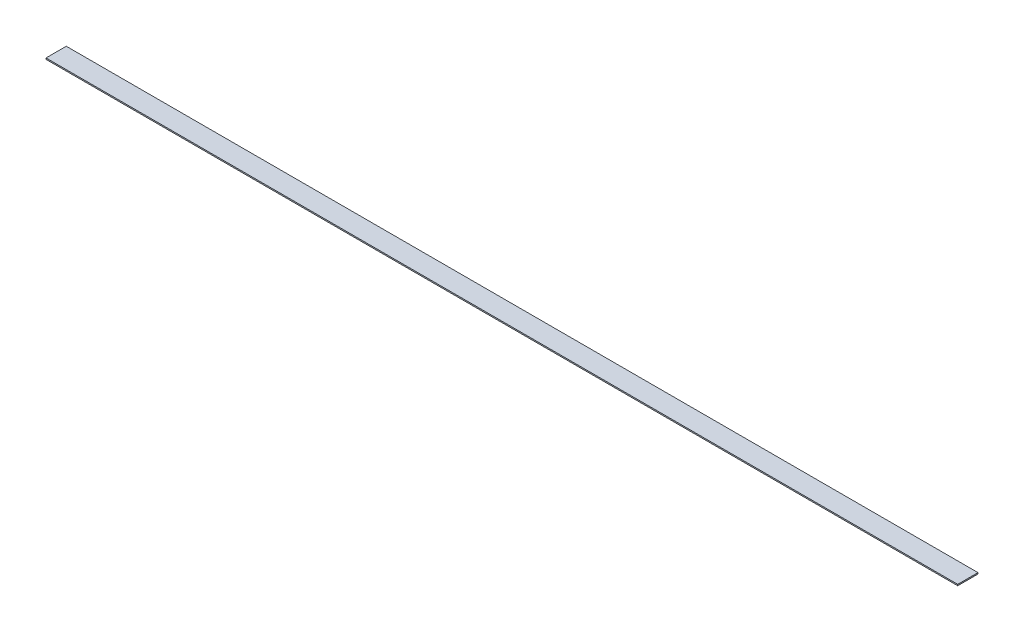
ISO-10303-21;
HEADER;
FILE_DESCRIPTION(('STEP AP214'),'2;1');
FILE_NAME('part.step','',(''),(''),'','','');
FILE_SCHEMA(('AUTOMOTIVE_DESIGN { 1 0 10303 214 1 1 1 1 }'));
ENDSEC;
DATA;
#1=APPLICATION_CONTEXT('core data for automotive mechanical design processes');
#2=APPLICATION_PROTOCOL_DEFINITION('international standard','automotive_design',2000,#1);
#3=PRODUCT_CONTEXT('',#1,'mechanical');
#4=PRODUCT('Part','Part','',(#3));
#5=PRODUCT_RELATED_PRODUCT_CATEGORY('part','',(#4));
#6=PRODUCT_DEFINITION_FORMATION('','',#4);
#7=PRODUCT_DEFINITION_CONTEXT('part definition',#1,'design');
#8=PRODUCT_DEFINITION('design','',#6,#7);
#9=PRODUCT_DEFINITION_SHAPE('','',#8);
#10=(LENGTH_UNIT() NAMED_UNIT(*) SI_UNIT(.MILLI.,.METRE.));
#11=(NAMED_UNIT(*) PLANE_ANGLE_UNIT() SI_UNIT($,.RADIAN.));
#12=(NAMED_UNIT(*) SI_UNIT($,.STERADIAN.) SOLID_ANGLE_UNIT());
#13=UNCERTAINTY_MEASURE_WITH_UNIT(LENGTH_MEASURE(1.E-05),#10,'distance_accuracy_value','');
#14=(GEOMETRIC_REPRESENTATION_CONTEXT(3) GLOBAL_UNCERTAINTY_ASSIGNED_CONTEXT((#13)) GLOBAL_UNIT_ASSIGNED_CONTEXT((#10,
#11,#12)) REPRESENTATION_CONTEXT('',''));
#15=CARTESIAN_POINT('',(0.,0.,0.));
#16=DIRECTION('',(0.,0.,1.));
#17=DIRECTION('',(1.,0.,0.));
#18=AXIS2_PLACEMENT_3D('',#15,#16,#17);
#19=CARTESIAN_POINT('',(0.,1.58750000000001,0.));
#20=DIRECTION('',(1.,0.,0.));
#21=DIRECTION('',(0.,0.,-1.));
#22=AXIS2_PLACEMENT_3D('',#19,#20,#21);
#23=PLANE('',#22);
#24=DIRECTION('',(0.,0.,1.));
#25=VECTOR('',#24,1.);
#26=CARTESIAN_POINT('',(0.,0.,0.));
#27=LINE('',#26,#25);
#28=CARTESIAN_POINT('',(0.,0.,-25.4));
#29=VERTEX_POINT('',#28);
#30=CARTESIAN_POINT('',(0.,0.,0.));
#31=VERTEX_POINT('',#30);
#32=EDGE_CURVE('E95',#29,#31,#27,.T.);
#33=ORIENTED_EDGE('',*,*,#32,.T.);
#34=DIRECTION('',(0.,-1.,0.));
#35=VECTOR('',#34,1.);
#36=CARTESIAN_POINT('',(0.,1.58750000000001,0.));
#37=LINE('',#36,#35);
#38=CARTESIAN_POINT('',(0.,1.58750000000001,0.));
#39=VERTEX_POINT('',#38);
#40=EDGE_CURVE('E11',#39,#31,#37,.T.);
#41=ORIENTED_EDGE('',*,*,#40,.F.);
#42=DIRECTION('',(0.,0.,1.));
#43=VECTOR('',#42,1.);
#44=CARTESIAN_POINT('',(0.,1.58750000000001,0.));
#45=LINE('',#44,#43);
#46=CARTESIAN_POINT('',(0.,1.58749999999999,-25.4));
#47=VERTEX_POINT('',#46);
#48=EDGE_CURVE('E83',#47,#39,#45,.T.);
#49=ORIENTED_EDGE('',*,*,#48,.F.);
#50=DIRECTION('',(0.,-1.,0.));
#51=VECTOR('',#50,1.);
#52=CARTESIAN_POINT('',(0.,1.58749999999999,-25.4));
#53=LINE('',#52,#51);
#54=EDGE_CURVE('E91',#47,#29,#53,.T.);
#55=ORIENTED_EDGE('',*,*,#54,.T.);
#56=EDGE_LOOP('',(#33,#41,#49,#55));
#57=FACE_BOUND('',#56,.T.);
#58=ADVANCED_FACE('F32',(#57),#23,.F.);
#59=CARTESIAN_POINT('',(0.,1.58750000000001,0.));
#60=DIRECTION('',(0.,0.,-1.));
#61=DIRECTION('',(-1.,0.,0.));
#62=AXIS2_PLACEMENT_3D('',#59,#60,#61);
#63=PLANE('',#62);
#64=DIRECTION('',(1.,0.,0.));
#65=VECTOR('',#64,1.);
#66=CARTESIAN_POINT('',(0.,0.,0.));
#67=LINE('',#66,#65);
#68=CARTESIAN_POINT('',(1143.,9.29811783123569E-13,0.));
#69=VERTEX_POINT('',#68);
#70=EDGE_CURVE('E87',#31,#69,#67,.T.);
#71=ORIENTED_EDGE('',*,*,#70,.T.);
#72=DIRECTION('',(0.,-1.,0.));
#73=VECTOR('',#72,1.);
#74=CARTESIAN_POINT('',(1143.,1.58750000000092,0.));
#75=LINE('',#74,#73);
#76=CARTESIAN_POINT('',(1143.,1.58750000000092,0.));
#77=VERTEX_POINT('',#76);
#78=EDGE_CURVE('E40',#77,#69,#75,.T.);
#79=ORIENTED_EDGE('',*,*,#78,.F.);
#80=DIRECTION('',(1.,0.,0.));
#81=VECTOR('',#80,1.);
#82=CARTESIAN_POINT('',(0.,1.58750000000001,0.));
#83=LINE('',#82,#81);
#84=EDGE_CURVE('E78',#39,#77,#83,.T.);
#85=ORIENTED_EDGE('',*,*,#84,.F.);
#86=ORIENTED_EDGE('',*,*,#40,.T.);
#87=EDGE_LOOP('',(#71,#79,#85,#86));
#88=FACE_BOUND('',#87,.T.);
#89=ADVANCED_FACE('F86',(#88),#63,.F.);
#90=CARTESIAN_POINT('',(1143.,1.58750000000092,0.));
#91=DIRECTION('',(-1.,0.,0.));
#92=DIRECTION('',(0.,0.,1.));
#93=AXIS2_PLACEMENT_3D('',#90,#91,#92);
#94=PLANE('',#93);
#95=DIRECTION('',(0.,0.,-1.));
#96=VECTOR('',#95,1.);
#97=CARTESIAN_POINT('',(1143.,9.29811783123569E-13,0.));
#98=LINE('',#97,#96);
#99=CARTESIAN_POINT('',(1143.,8.74300631892311E-13,-25.4));
#100=VERTEX_POINT('',#99);
#101=EDGE_CURVE('E65',#69,#100,#98,.T.);
#102=ORIENTED_EDGE('',*,*,#101,.T.);
#103=DIRECTION('',(0.,-1.,0.));
#104=VECTOR('',#103,1.);
#105=CARTESIAN_POINT('',(1143.,1.58750000000088,-25.4));
#106=LINE('',#105,#104);
#107=CARTESIAN_POINT('',(1143.,1.58750000000088,-25.4));
#108=VERTEX_POINT('',#107);
#109=EDGE_CURVE('E88',#108,#100,#106,.T.);
#110=ORIENTED_EDGE('',*,*,#109,.F.);
#111=DIRECTION('',(0.,0.,-1.));
#112=VECTOR('',#111,1.);
#113=CARTESIAN_POINT('',(1143.,1.58750000000092,0.));
#114=LINE('',#113,#112);
#115=EDGE_CURVE('E81',#77,#108,#114,.T.);
#116=ORIENTED_EDGE('',*,*,#115,.F.);
#117=ORIENTED_EDGE('',*,*,#78,.T.);
#118=EDGE_LOOP('',(#102,#110,#116,#117));
#119=FACE_BOUND('',#118,.T.);
#120=ADVANCED_FACE('F89',(#119),#94,.F.);
#121=CARTESIAN_POINT('',(0.,1.58749999999999,-25.4));
#122=DIRECTION('',(0.,0.,1.));
#123=DIRECTION('',(1.,0.,0.));
#124=AXIS2_PLACEMENT_3D('',#121,#122,#123);
#125=PLANE('',#124);
#126=DIRECTION('',(-1.,0.,0.));
#127=VECTOR('',#126,1.);
#128=CARTESIAN_POINT('',(0.,0.,-25.4));
#129=LINE('',#128,#127);
#130=EDGE_CURVE('E71',#100,#29,#129,.T.);
#131=ORIENTED_EDGE('',*,*,#130,.T.);
#132=ORIENTED_EDGE('',*,*,#54,.F.);
#133=DIRECTION('',(-1.,0.,0.));
#134=VECTOR('',#133,1.);
#135=CARTESIAN_POINT('',(0.,1.58749999999999,-25.4));
#136=LINE('',#135,#134);
#137=EDGE_CURVE('E48',#108,#47,#136,.T.);
#138=ORIENTED_EDGE('',*,*,#137,.F.);
#139=ORIENTED_EDGE('',*,*,#109,.T.);
#140=EDGE_LOOP('',(#131,#132,#138,#139));
#141=FACE_BOUND('',#140,.T.);
#142=ADVANCED_FACE('F102',(#141),#125,.F.);
#143=CARTESIAN_POINT('',(0.,1.58750000000001,0.));
#144=DIRECTION('',(0.,-1.,0.));
#145=DIRECTION('',(0.,0.,-1.));
#146=AXIS2_PLACEMENT_3D('',#143,#144,#145);
#147=PLANE('',#146);
#148=ORIENTED_EDGE('',*,*,#48,.T.);
#149=ORIENTED_EDGE('',*,*,#84,.T.);
#150=ORIENTED_EDGE('',*,*,#115,.T.);
#151=ORIENTED_EDGE('',*,*,#137,.T.);
#152=EDGE_LOOP('',(#148,#149,#150,#151));
#153=FACE_BOUND('',#152,.T.);
#154=ADVANCED_FACE('F79',(#153),#147,.F.);
#155=CARTESIAN_POINT('',(0.,0.,0.));
#156=DIRECTION('',(0.,-1.,0.));
#157=DIRECTION('',(0.,0.,-1.));
#158=AXIS2_PLACEMENT_3D('',#155,#156,#157);
#159=PLANE('',#158);
#160=ORIENTED_EDGE('',*,*,#32,.F.);
#161=ORIENTED_EDGE('',*,*,#130,.F.);
#162=ORIENTED_EDGE('',*,*,#101,.F.);
#163=ORIENTED_EDGE('',*,*,#70,.F.);
#164=EDGE_LOOP('',(#160,#161,#162,#163));
#165=FACE_BOUND('',#164,.T.);
#166=ADVANCED_FACE('F105',(#165),#159,.T.);
#167=CLOSED_SHELL('',(#58,#89,#120,#142,#154,#166));
#168=MANIFOLD_SOLID_BREP('B2',#167);
#169=ADVANCED_BREP_SHAPE_REPRESENTATION('',(#18,#168),#14);
#170=SHAPE_DEFINITION_REPRESENTATION(#9,#169);
ENDSEC;
END-ISO-10303-21;
